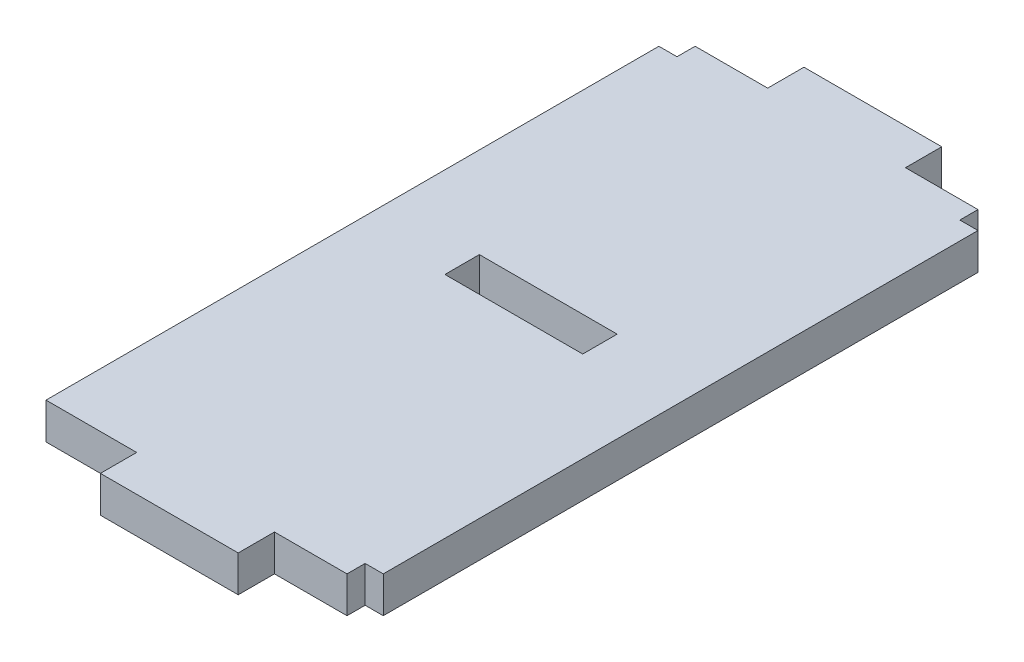
ISO-10303-21;
HEADER;
FILE_DESCRIPTION(('STEP AP214'),'2;1');
FILE_NAME('part.step','',(''),(''),'','','');
FILE_SCHEMA(('AUTOMOTIVE_DESIGN { 1 0 10303 214 1 1 1 1 }'));
ENDSEC;
DATA;
#1=APPLICATION_CONTEXT('core data for automotive mechanical design processes');
#2=APPLICATION_PROTOCOL_DEFINITION('international standard','automotive_design',2000,#1);
#3=PRODUCT_CONTEXT('',#1,'mechanical');
#4=PRODUCT('Part','Part','',(#3));
#5=PRODUCT_RELATED_PRODUCT_CATEGORY('part','',(#4));
#6=PRODUCT_DEFINITION_FORMATION('','',#4);
#7=PRODUCT_DEFINITION_CONTEXT('part definition',#1,'design');
#8=PRODUCT_DEFINITION('design','',#6,#7);
#9=PRODUCT_DEFINITION_SHAPE('','',#8);
#10=(LENGTH_UNIT() NAMED_UNIT(*) SI_UNIT(.MILLI.,.METRE.));
#11=(NAMED_UNIT(*) PLANE_ANGLE_UNIT() SI_UNIT($,.RADIAN.));
#12=(NAMED_UNIT(*) SI_UNIT($,.STERADIAN.) SOLID_ANGLE_UNIT());
#13=UNCERTAINTY_MEASURE_WITH_UNIT(LENGTH_MEASURE(1.E-05),#10,'distance_accuracy_value','');
#14=(GEOMETRIC_REPRESENTATION_CONTEXT(3) GLOBAL_UNCERTAINTY_ASSIGNED_CONTEXT((#13)) GLOBAL_UNIT_ASSIGNED_CONTEXT((#10,
#11,#12)) REPRESENTATION_CONTEXT('',''));
#15=CARTESIAN_POINT('',(0.,0.,0.));
#16=DIRECTION('',(0.,0.,1.));
#17=DIRECTION('',(1.,0.,0.));
#18=AXIS2_PLACEMENT_3D('',#15,#16,#17);
#19=CARTESIAN_POINT('',(0.,2.,0.));
#20=DIRECTION('',(0.,0.,-1.));
#21=DIRECTION('',(-1.,0.,0.));
#22=AXIS2_PLACEMENT_3D('',#19,#20,#21);
#23=PLANE('',#22);
#24=DIRECTION('',(1.,0.,0.));
#25=VECTOR('',#24,1.);
#26=CARTESIAN_POINT('',(0.,0.,0.));
#27=LINE('',#26,#25);
#28=CARTESIAN_POINT('',(0.,0.,0.));
#29=VERTEX_POINT('',#28);
#30=CARTESIAN_POINT('',(5.,0.,0.));
#31=VERTEX_POINT('',#30);
#32=EDGE_CURVE('E233',#29,#31,#27,.T.);
#33=ORIENTED_EDGE('',*,*,#32,.T.);
#34=DIRECTION('',(0.,-1.,0.));
#35=VECTOR('',#34,1.);
#36=CARTESIAN_POINT('',(5.,2.,0.));
#37=LINE('',#36,#35);
#38=CARTESIAN_POINT('',(5.,2.,0.));
#39=VERTEX_POINT('',#38);
#40=EDGE_CURVE('E11',#39,#31,#37,.T.);
#41=ORIENTED_EDGE('',*,*,#40,.F.);
#42=DIRECTION('',(1.,0.,0.));
#43=VECTOR('',#42,1.);
#44=CARTESIAN_POINT('',(0.,2.,0.));
#45=LINE('',#44,#43);
#46=CARTESIAN_POINT('',(0.,2.,0.));
#47=VERTEX_POINT('',#46);
#48=EDGE_CURVE('E624',#47,#39,#45,.T.);
#49=ORIENTED_EDGE('',*,*,#48,.F.);
#50=DIRECTION('',(0.,-1.,0.));
#51=VECTOR('',#50,1.);
#52=CARTESIAN_POINT('',(0.,2.,0.));
#53=LINE('',#52,#51);
#54=EDGE_CURVE('E54',#47,#29,#53,.T.);
#55=ORIENTED_EDGE('',*,*,#54,.T.);
#56=EDGE_LOOP('',(#33,#41,#49,#55));
#57=FACE_BOUND('',#56,.T.);
#58=ADVANCED_FACE('F35',(#57),#23,.F.);
#59=CARTESIAN_POINT('',(5.,2.,0.));
#60=DIRECTION('',(1.,0.,0.));
#61=DIRECTION('',(0.,0.,-1.));
#62=AXIS2_PLACEMENT_3D('',#59,#60,#61);
#63=PLANE('',#62);
#64=DIRECTION('',(0.,0.,1.));
#65=VECTOR('',#64,1.);
#66=CARTESIAN_POINT('',(5.,0.,0.));
#67=LINE('',#66,#65);
#68=CARTESIAN_POINT('',(5.,0.,2.));
#69=VERTEX_POINT('',#68);
#70=EDGE_CURVE('E235',#31,#69,#67,.T.);
#71=ORIENTED_EDGE('',*,*,#70,.T.);
#72=DIRECTION('',(0.,-1.,0.));
#73=VECTOR('',#72,1.);
#74=CARTESIAN_POINT('',(5.,2.,2.));
#75=LINE('',#74,#73);
#76=CARTESIAN_POINT('',(5.,2.,2.));
#77=VERTEX_POINT('',#76);
#78=EDGE_CURVE('E45',#77,#69,#75,.T.);
#79=ORIENTED_EDGE('',*,*,#78,.F.);
#80=DIRECTION('',(0.,0.,1.));
#81=VECTOR('',#80,1.);
#82=CARTESIAN_POINT('',(5.,2.,0.));
#83=LINE('',#82,#81);
#84=EDGE_CURVE('E625',#39,#77,#83,.T.);
#85=ORIENTED_EDGE('',*,*,#84,.F.);
#86=ORIENTED_EDGE('',*,*,#40,.T.);
#87=EDGE_LOOP('',(#71,#79,#85,#86));
#88=FACE_BOUND('',#87,.T.);
#89=ADVANCED_FACE('F340',(#88),#63,.F.);
#90=CARTESIAN_POINT('',(0.,2.,2.));
#91=DIRECTION('',(0.,0.,-1.));
#92=DIRECTION('',(-1.,0.,0.));
#93=AXIS2_PLACEMENT_3D('',#90,#91,#92);
#94=PLANE('',#93);
#95=DIRECTION('',(1.,0.,0.));
#96=VECTOR('',#95,1.);
#97=CARTESIAN_POINT('',(0.,0.,2.));
#98=LINE('',#97,#96);
#99=CARTESIAN_POINT('',(12.6,0.,2.));
#100=VERTEX_POINT('',#99);
#101=EDGE_CURVE('E238',#69,#100,#98,.T.);
#102=ORIENTED_EDGE('',*,*,#101,.T.);
#103=DIRECTION('',(0.,-1.,0.));
#104=VECTOR('',#103,1.);
#105=CARTESIAN_POINT('',(12.6,2.,2.));
#106=LINE('',#105,#104);
#107=CARTESIAN_POINT('',(12.6,2.,2.));
#108=VERTEX_POINT('',#107);
#109=EDGE_CURVE('E305',#108,#100,#106,.T.);
#110=ORIENTED_EDGE('',*,*,#109,.F.);
#111=DIRECTION('',(1.,0.,0.));
#112=VECTOR('',#111,1.);
#113=CARTESIAN_POINT('',(0.,2.,2.));
#114=LINE('',#113,#112);
#115=EDGE_CURVE('E622',#77,#108,#114,.T.);
#116=ORIENTED_EDGE('',*,*,#115,.F.);
#117=ORIENTED_EDGE('',*,*,#78,.T.);
#118=EDGE_LOOP('',(#102,#110,#116,#117));
#119=FACE_BOUND('',#118,.T.);
#120=ADVANCED_FACE('F346',(#119),#94,.F.);
#121=CARTESIAN_POINT('',(12.6,2.,0.));
#122=DIRECTION('',(1.,0.,0.));
#123=DIRECTION('',(0.,0.,-1.));
#124=AXIS2_PLACEMENT_3D('',#121,#122,#123);
#125=PLANE('',#124);
#126=DIRECTION('',(0.,0.,1.));
#127=VECTOR('',#126,1.);
#128=CARTESIAN_POINT('',(12.6,0.,0.));
#129=LINE('',#128,#127);
#130=CARTESIAN_POINT('',(12.6,0.,0.));
#131=VERTEX_POINT('',#130);
#132=EDGE_CURVE('E241',#131,#100,#129,.T.);
#133=ORIENTED_EDGE('',*,*,#132,.F.);
#134=DIRECTION('',(0.,-1.,0.));
#135=VECTOR('',#134,1.);
#136=CARTESIAN_POINT('',(12.6,2.,0.));
#137=LINE('',#136,#135);
#138=CARTESIAN_POINT('',(12.6,2.,0.));
#139=VERTEX_POINT('',#138);
#140=EDGE_CURVE('E303',#139,#131,#137,.T.);
#141=ORIENTED_EDGE('',*,*,#140,.F.);
#142=DIRECTION('',(0.,0.,1.));
#143=VECTOR('',#142,1.);
#144=CARTESIAN_POINT('',(12.6,2.,0.));
#145=LINE('',#144,#143);
#146=EDGE_CURVE('E621',#139,#108,#145,.T.);
#147=ORIENTED_EDGE('',*,*,#146,.T.);
#148=ORIENTED_EDGE('',*,*,#109,.T.);
#149=EDGE_LOOP('',(#133,#141,#147,#148));
#150=FACE_BOUND('',#149,.T.);
#151=ADVANCED_FACE('F353',(#150),#125,.T.);
#152=CARTESIAN_POINT('',(16.6,0.,0.));
#153=VERTEX_POINT('',#152);
#154=EDGE_CURVE('E236',#131,#153,#27,.T.);
#155=ORIENTED_EDGE('',*,*,#154,.T.);
#156=DIRECTION('',(0.,-1.,0.));
#157=VECTOR('',#156,1.);
#158=CARTESIAN_POINT('',(16.6,2.,0.));
#159=LINE('',#158,#157);
#160=CARTESIAN_POINT('',(16.6,2.,0.));
#161=VERTEX_POINT('',#160);
#162=EDGE_CURVE('E300',#161,#153,#159,.T.);
#163=ORIENTED_EDGE('',*,*,#162,.F.);
#164=EDGE_CURVE('E382',#139,#161,#45,.T.);
#165=ORIENTED_EDGE('',*,*,#164,.F.);
#166=ORIENTED_EDGE('',*,*,#140,.T.);
#167=EDGE_LOOP('',(#155,#163,#165,#166));
#168=FACE_BOUND('',#167,.T.);
#169=ADVANCED_FACE('F342',(#168),#23,.F.);
#170=CARTESIAN_POINT('',(16.6,2.,0.));
#171=DIRECTION('',(-1.,0.,0.));
#172=DIRECTION('',(0.,0.,1.));
#173=AXIS2_PLACEMENT_3D('',#170,#171,#172);
#174=PLANE('',#173);
#175=DIRECTION('',(0.,0.,-1.));
#176=VECTOR('',#175,1.);
#177=CARTESIAN_POINT('',(16.6,0.,0.));
#178=LINE('',#177,#176);
#179=CARTESIAN_POINT('',(16.6,0.,-1.));
#180=VERTEX_POINT('',#179);
#181=EDGE_CURVE('E244',#153,#180,#178,.T.);
#182=ORIENTED_EDGE('',*,*,#181,.T.);
#183=DIRECTION('',(0.,-1.,0.));
#184=VECTOR('',#183,1.);
#185=CARTESIAN_POINT('',(16.6,2.,-1.));
#186=LINE('',#185,#184);
#187=CARTESIAN_POINT('',(16.6,2.,-1.));
#188=VERTEX_POINT('',#187);
#189=EDGE_CURVE('E298',#188,#180,#186,.T.);
#190=ORIENTED_EDGE('',*,*,#189,.F.);
#191=DIRECTION('',(0.,0.,-1.));
#192=VECTOR('',#191,1.);
#193=CARTESIAN_POINT('',(16.6,2.,0.));
#194=LINE('',#193,#192);
#195=EDGE_CURVE('E369',#161,#188,#194,.T.);
#196=ORIENTED_EDGE('',*,*,#195,.F.);
#197=ORIENTED_EDGE('',*,*,#162,.T.);
#198=EDGE_LOOP('',(#182,#190,#196,#197));
#199=FACE_BOUND('',#198,.T.);
#200=ADVANCED_FACE('F352',(#199),#174,.F.);
#201=CARTESIAN_POINT('',(0.,2.,-0.999999999999996));
#202=DIRECTION('',(0.,0.,1.));
#203=DIRECTION('',(1.,0.,0.));
#204=AXIS2_PLACEMENT_3D('',#201,#202,#203);
#205=PLANE('',#204);
#206=DIRECTION('',(-1.,0.,0.));
#207=VECTOR('',#206,1.);
#208=CARTESIAN_POINT('',(0.,0.,-0.999999999999996));
#209=LINE('',#208,#207);
#210=CARTESIAN_POINT('',(17.6,0.,-1.));
#211=VERTEX_POINT('',#210);
#212=EDGE_CURVE('E247',#211,#180,#209,.T.);
#213=ORIENTED_EDGE('',*,*,#212,.F.);
#214=DIRECTION('',(0.,-1.,0.));
#215=VECTOR('',#214,1.);
#216=CARTESIAN_POINT('',(17.6,2.,-1.));
#217=LINE('',#216,#215);
#218=CARTESIAN_POINT('',(17.6,2.,-1.));
#219=VERTEX_POINT('',#218);
#220=EDGE_CURVE('E296',#219,#211,#217,.T.);
#221=ORIENTED_EDGE('',*,*,#220,.F.);
#222=DIRECTION('',(-1.,0.,0.));
#223=VECTOR('',#222,1.);
#224=CARTESIAN_POINT('',(0.,2.,-0.999999999999996));
#225=LINE('',#224,#223);
#226=EDGE_CURVE('E377',#219,#188,#225,.T.);
#227=ORIENTED_EDGE('',*,*,#226,.T.);
#228=ORIENTED_EDGE('',*,*,#189,.T.);
#229=EDGE_LOOP('',(#213,#221,#227,#228));
#230=FACE_BOUND('',#229,.T.);
#231=ADVANCED_FACE('F359',(#230),#205,.T.);
#232=CARTESIAN_POINT('',(17.6,2.,0.));
#233=DIRECTION('',(-1.,0.,0.));
#234=DIRECTION('',(0.,0.,1.));
#235=AXIS2_PLACEMENT_3D('',#232,#233,#234);
#236=PLANE('',#235);
#237=DIRECTION('',(0.,0.,-1.));
#238=VECTOR('',#237,1.);
#239=CARTESIAN_POINT('',(17.6,0.,0.));
#240=LINE('',#239,#238);
#241=CARTESIAN_POINT('',(17.6,0.,-33.8));
#242=VERTEX_POINT('',#241);
#243=EDGE_CURVE('E250',#211,#242,#240,.T.);
#244=ORIENTED_EDGE('',*,*,#243,.T.);
#245=DIRECTION('',(0.,-1.,0.));
#246=VECTOR('',#245,1.);
#247=CARTESIAN_POINT('',(17.6,2.,-33.8));
#248=LINE('',#247,#246);
#249=CARTESIAN_POINT('',(17.6,2.,-33.8));
#250=VERTEX_POINT('',#249);
#251=EDGE_CURVE('E293',#250,#242,#248,.T.);
#252=ORIENTED_EDGE('',*,*,#251,.F.);
#253=DIRECTION('',(0.,0.,-1.));
#254=VECTOR('',#253,1.);
#255=CARTESIAN_POINT('',(17.6,2.,0.));
#256=LINE('',#255,#254);
#257=EDGE_CURVE('E378',#219,#250,#256,.T.);
#258=ORIENTED_EDGE('',*,*,#257,.F.);
#259=ORIENTED_EDGE('',*,*,#220,.T.);
#260=EDGE_LOOP('',(#244,#252,#258,#259));
#261=FACE_BOUND('',#260,.T.);
#262=ADVANCED_FACE('F442',(#261),#236,.F.);
#263=CARTESIAN_POINT('',(0.,2.,-33.8));
#264=DIRECTION('',(0.,0.,1.));
#265=DIRECTION('',(1.,0.,0.));
#266=AXIS2_PLACEMENT_3D('',#263,#264,#265);
#267=PLANE('',#266);
#268=DIRECTION('',(-1.,0.,0.));
#269=VECTOR('',#268,1.);
#270=CARTESIAN_POINT('',(0.,0.,-33.8));
#271=LINE('',#270,#269);
#272=CARTESIAN_POINT('',(16.6,0.,-33.8));
#273=VERTEX_POINT('',#272);
#274=EDGE_CURVE('E252',#242,#273,#271,.T.);
#275=ORIENTED_EDGE('',*,*,#274,.T.);
#276=DIRECTION('',(0.,-1.,0.));
#277=VECTOR('',#276,1.);
#278=CARTESIAN_POINT('',(16.6,2.,-33.8));
#279=LINE('',#278,#277);
#280=CARTESIAN_POINT('',(16.6,2.,-33.8));
#281=VERTEX_POINT('',#280);
#282=EDGE_CURVE('E291',#281,#273,#279,.T.);
#283=ORIENTED_EDGE('',*,*,#282,.F.);
#284=DIRECTION('',(-1.,0.,0.));
#285=VECTOR('',#284,1.);
#286=CARTESIAN_POINT('',(0.,2.,-33.8));
#287=LINE('',#286,#285);
#288=EDGE_CURVE('E380',#250,#281,#287,.T.);
#289=ORIENTED_EDGE('',*,*,#288,.F.);
#290=ORIENTED_EDGE('',*,*,#251,.T.);
#291=EDGE_LOOP('',(#275,#283,#289,#290));
#292=FACE_BOUND('',#291,.T.);
#293=ADVANCED_FACE('F438',(#292),#267,.F.);
#294=CARTESIAN_POINT('',(16.6,2.,0.));
#295=DIRECTION('',(1.,0.,0.));
#296=DIRECTION('',(0.,0.,-1.));
#297=AXIS2_PLACEMENT_3D('',#294,#295,#296);
#298=PLANE('',#297);
#299=DIRECTION('',(0.,0.,1.));
#300=VECTOR('',#299,1.);
#301=CARTESIAN_POINT('',(16.6,0.,0.));
#302=LINE('',#301,#300);
#303=CARTESIAN_POINT('',(16.6,0.,-34.8));
#304=VERTEX_POINT('',#303);
#305=EDGE_CURVE('E255',#304,#273,#302,.T.);
#306=ORIENTED_EDGE('',*,*,#305,.F.);
#307=DIRECTION('',(0.,-1.,0.));
#308=VECTOR('',#307,1.);
#309=CARTESIAN_POINT('',(16.6,2.,-34.8));
#310=LINE('',#309,#308);
#311=CARTESIAN_POINT('',(16.6,2.,-34.8));
#312=VERTEX_POINT('',#311);
#313=EDGE_CURVE('E289',#312,#304,#310,.T.);
#314=ORIENTED_EDGE('',*,*,#313,.F.);
#315=DIRECTION('',(0.,0.,1.));
#316=VECTOR('',#315,1.);
#317=CARTESIAN_POINT('',(16.6,2.,0.));
#318=LINE('',#317,#316);
#319=EDGE_CURVE('E387',#312,#281,#318,.T.);
#320=ORIENTED_EDGE('',*,*,#319,.T.);
#321=ORIENTED_EDGE('',*,*,#282,.T.);
#322=EDGE_LOOP('',(#306,#314,#320,#321));
#323=FACE_BOUND('',#322,.T.);
#324=ADVANCED_FACE('F435',(#323),#298,.T.);
#325=CARTESIAN_POINT('',(0.,2.,-34.8));
#326=DIRECTION('',(0.,0.,-1.));
#327=DIRECTION('',(-1.,0.,0.));
#328=AXIS2_PLACEMENT_3D('',#325,#326,#327);
#329=PLANE('',#328);
#330=DIRECTION('',(1.,0.,0.));
#331=VECTOR('',#330,1.);
#332=CARTESIAN_POINT('',(0.,0.,-34.8));
#333=LINE('',#332,#331);
#334=CARTESIAN_POINT('',(12.6,0.,-34.8));
#335=VERTEX_POINT('',#334);
#336=EDGE_CURVE('E258',#335,#304,#333,.T.);
#337=ORIENTED_EDGE('',*,*,#336,.F.);
#338=DIRECTION('',(0.,-1.,0.));
#339=VECTOR('',#338,1.);
#340=CARTESIAN_POINT('',(12.6,2.,-34.8));
#341=LINE('',#340,#339);
#342=CARTESIAN_POINT('',(12.6,2.,-34.8));
#343=VERTEX_POINT('',#342);
#344=EDGE_CURVE('E287',#343,#335,#341,.T.);
#345=ORIENTED_EDGE('',*,*,#344,.F.);
#346=DIRECTION('',(1.,0.,0.));
#347=VECTOR('',#346,1.);
#348=CARTESIAN_POINT('',(0.,2.,-34.8));
#349=LINE('',#348,#347);
#350=EDGE_CURVE('E390',#343,#312,#349,.T.);
#351=ORIENTED_EDGE('',*,*,#350,.T.);
#352=ORIENTED_EDGE('',*,*,#313,.T.);
#353=EDGE_LOOP('',(#337,#345,#351,#352));
#354=FACE_BOUND('',#353,.T.);
#355=ADVANCED_FACE('F423',(#354),#329,.T.);
#356=CARTESIAN_POINT('',(12.6,2.,0.));
#357=DIRECTION('',(1.,0.,0.));
#358=DIRECTION('',(0.,0.,-1.));
#359=AXIS2_PLACEMENT_3D('',#356,#357,#358);
#360=PLANE('',#359);
#361=DIRECTION('',(0.,0.,1.));
#362=VECTOR('',#361,1.);
#363=CARTESIAN_POINT('',(12.6,0.,0.));
#364=LINE('',#363,#362);
#365=CARTESIAN_POINT('',(12.6,0.,-36.8));
#366=VERTEX_POINT('',#365);
#367=EDGE_CURVE('E261',#366,#335,#364,.T.);
#368=ORIENTED_EDGE('',*,*,#367,.F.);
#369=DIRECTION('',(0.,-1.,0.));
#370=VECTOR('',#369,1.);
#371=CARTESIAN_POINT('',(12.6,2.,-36.8));
#372=LINE('',#371,#370);
#373=CARTESIAN_POINT('',(12.6,2.,-36.8));
#374=VERTEX_POINT('',#373);
#375=EDGE_CURVE('E285',#374,#366,#372,.T.);
#376=ORIENTED_EDGE('',*,*,#375,.F.);
#377=DIRECTION('',(0.,0.,1.));
#378=VECTOR('',#377,1.);
#379=CARTESIAN_POINT('',(12.6,2.,0.));
#380=LINE('',#379,#378);
#381=EDGE_CURVE('E393',#374,#343,#380,.T.);
#382=ORIENTED_EDGE('',*,*,#381,.T.);
#383=ORIENTED_EDGE('',*,*,#344,.T.);
#384=EDGE_LOOP('',(#368,#376,#382,#383));
#385=FACE_BOUND('',#384,.T.);
#386=ADVANCED_FACE('F430',(#385),#360,.T.);
#387=CARTESIAN_POINT('',(0.,2.,-36.8));
#388=DIRECTION('',(0.,0.,-1.));
#389=DIRECTION('',(-1.,0.,0.));
#390=AXIS2_PLACEMENT_3D('',#387,#388,#389);
#391=PLANE('',#390);
#392=DIRECTION('',(1.,0.,0.));
#393=VECTOR('',#392,1.);
#394=CARTESIAN_POINT('',(0.,0.,-36.8));
#395=LINE('',#394,#393);
#396=CARTESIAN_POINT('',(5.,0.,-36.8));
#397=VERTEX_POINT('',#396);
#398=EDGE_CURVE('E265',#397,#366,#395,.T.);
#399=ORIENTED_EDGE('',*,*,#398,.F.);
#400=DIRECTION('',(0.,-1.,0.));
#401=VECTOR('',#400,1.);
#402=CARTESIAN_POINT('',(5.,2.,-36.8));
#403=LINE('',#402,#401);
#404=CARTESIAN_POINT('',(5.,2.,-36.8));
#405=VERTEX_POINT('',#404);
#406=EDGE_CURVE('E283',#405,#397,#403,.T.);
#407=ORIENTED_EDGE('',*,*,#406,.F.);
#408=DIRECTION('',(1.,0.,0.));
#409=VECTOR('',#408,1.);
#410=CARTESIAN_POINT('',(0.,2.,-36.8));
#411=LINE('',#410,#409);
#412=EDGE_CURVE('E396',#405,#374,#411,.T.);
#413=ORIENTED_EDGE('',*,*,#412,.T.);
#414=ORIENTED_EDGE('',*,*,#375,.T.);
#415=EDGE_LOOP('',(#399,#407,#413,#414));
#416=FACE_BOUND('',#415,.T.);
#417=ADVANCED_FACE('F426',(#416),#391,.T.);
#418=CARTESIAN_POINT('',(5.,2.,0.));
#419=DIRECTION('',(1.,0.,0.));
#420=DIRECTION('',(0.,0.,-1.));
#421=AXIS2_PLACEMENT_3D('',#418,#419,#420);
#422=PLANE('',#421);
#423=DIRECTION('',(0.,0.,1.));
#424=VECTOR('',#423,1.);
#425=CARTESIAN_POINT('',(5.,0.,0.));
#426=LINE('',#425,#424);
#427=CARTESIAN_POINT('',(5.,0.,-34.8));
#428=VERTEX_POINT('',#427);
#429=EDGE_CURVE('E268',#397,#428,#426,.T.);
#430=ORIENTED_EDGE('',*,*,#429,.T.);
#431=DIRECTION('',(0.,-1.,0.));
#432=VECTOR('',#431,1.);
#433=CARTESIAN_POINT('',(5.,2.,-34.8));
#434=LINE('',#433,#432);
#435=CARTESIAN_POINT('',(5.,2.,-34.8));
#436=VERTEX_POINT('',#435);
#437=EDGE_CURVE('E281',#436,#428,#434,.T.);
#438=ORIENTED_EDGE('',*,*,#437,.F.);
#439=DIRECTION('',(0.,0.,1.));
#440=VECTOR('',#439,1.);
#441=CARTESIAN_POINT('',(5.,2.,0.));
#442=LINE('',#441,#440);
#443=EDGE_CURVE('E398',#405,#436,#442,.T.);
#444=ORIENTED_EDGE('',*,*,#443,.F.);
#445=ORIENTED_EDGE('',*,*,#406,.T.);
#446=EDGE_LOOP('',(#430,#438,#444,#445));
#447=FACE_BOUND('',#446,.T.);
#448=ADVANCED_FACE('F422',(#447),#422,.F.);
#449=CARTESIAN_POINT('',(1.,0.,-34.8));
#450=VERTEX_POINT('',#449);
#451=EDGE_CURVE('E262',#450,#428,#333,.T.);
#452=ORIENTED_EDGE('',*,*,#451,.F.);
#453=DIRECTION('',(0.,-1.,0.));
#454=VECTOR('',#453,1.);
#455=CARTESIAN_POINT('',(1.,2.,-34.8));
#456=LINE('',#455,#454);
#457=CARTESIAN_POINT('',(1.,2.,-34.8));
#458=VERTEX_POINT('',#457);
#459=EDGE_CURVE('E212',#458,#450,#456,.T.);
#460=ORIENTED_EDGE('',*,*,#459,.F.);
#461=EDGE_CURVE('E202',#458,#436,#349,.T.);
#462=ORIENTED_EDGE('',*,*,#461,.T.);
#463=ORIENTED_EDGE('',*,*,#437,.T.);
#464=EDGE_LOOP('',(#452,#460,#462,#463));
#465=FACE_BOUND('',#464,.T.);
#466=ADVANCED_FACE('F404',(#465),#329,.T.);
#467=CARTESIAN_POINT('',(1.00000000000001,2.,0.));
#468=DIRECTION('',(1.,0.,0.));
#469=DIRECTION('',(0.,0.,-1.));
#470=AXIS2_PLACEMENT_3D('',#467,#468,#469);
#471=PLANE('',#470);
#472=DIRECTION('',(0.,0.,1.));
#473=VECTOR('',#472,1.);
#474=CARTESIAN_POINT('',(1.00000000000001,0.,0.));
#475=LINE('',#474,#473);
#476=CARTESIAN_POINT('',(1.,0.,-33.8));
#477=VERTEX_POINT('',#476);
#478=EDGE_CURVE('E209',#450,#477,#475,.T.);
#479=ORIENTED_EDGE('',*,*,#478,.T.);
#480=DIRECTION('',(0.,-1.,0.));
#481=VECTOR('',#480,1.);
#482=CARTESIAN_POINT('',(1.,2.,-33.8));
#483=LINE('',#482,#481);
#484=CARTESIAN_POINT('',(1.,2.,-33.8));
#485=VERTEX_POINT('',#484);
#486=EDGE_CURVE('E206',#485,#477,#483,.T.);
#487=ORIENTED_EDGE('',*,*,#486,.F.);
#488=DIRECTION('',(0.,0.,1.));
#489=VECTOR('',#488,1.);
#490=CARTESIAN_POINT('',(1.00000000000001,2.,0.));
#491=LINE('',#490,#489);
#492=EDGE_CURVE('E194',#458,#485,#491,.T.);
#493=ORIENTED_EDGE('',*,*,#492,.F.);
#494=ORIENTED_EDGE('',*,*,#459,.T.);
#495=EDGE_LOOP('',(#479,#487,#493,#494));
#496=FACE_BOUND('',#495,.T.);
#497=ADVANCED_FACE('F207',(#496),#471,.F.);
#498=CARTESIAN_POINT('',(0.,2.,-33.8));
#499=DIRECTION('',(0.,0.,-1.));
#500=DIRECTION('',(-1.,0.,0.));
#501=AXIS2_PLACEMENT_3D('',#498,#499,#500);
#502=PLANE('',#501);
#503=DIRECTION('',(1.,0.,0.));
#504=VECTOR('',#503,1.);
#505=CARTESIAN_POINT('',(0.,0.,-33.8));
#506=LINE('',#505,#504);
#507=CARTESIAN_POINT('',(0.,0.,-33.8));
#508=VERTEX_POINT('',#507);
#509=EDGE_CURVE('E272',#508,#477,#506,.T.);
#510=ORIENTED_EDGE('',*,*,#509,.F.);
#511=DIRECTION('',(0.,-1.,0.));
#512=VECTOR('',#511,1.);
#513=CARTESIAN_POINT('',(0.,2.,-33.8));
#514=LINE('',#513,#512);
#515=CARTESIAN_POINT('',(0.,2.,-33.8));
#516=VERTEX_POINT('',#515);
#517=EDGE_CURVE('E122',#516,#508,#514,.T.);
#518=ORIENTED_EDGE('',*,*,#517,.F.);
#519=DIRECTION('',(1.,0.,0.));
#520=VECTOR('',#519,1.);
#521=CARTESIAN_POINT('',(0.,2.,-33.8));
#522=LINE('',#521,#520);
#523=EDGE_CURVE('E200',#516,#485,#522,.T.);
#524=ORIENTED_EDGE('',*,*,#523,.T.);
#525=ORIENTED_EDGE('',*,*,#486,.T.);
#526=EDGE_LOOP('',(#510,#518,#524,#525));
#527=FACE_BOUND('',#526,.T.);
#528=ADVANCED_FACE('F214',(#527),#502,.T.);
#529=CARTESIAN_POINT('',(0.,2.,-18.9));
#530=DIRECTION('',(0.,0.,-1.));
#531=DIRECTION('',(-1.,0.,0.));
#532=AXIS2_PLACEMENT_3D('',#529,#530,#531);
#533=PLANE('',#532);
#534=DIRECTION('',(1.,0.,0.));
#535=VECTOR('',#534,1.);
#536=CARTESIAN_POINT('',(0.,0.,-18.9));
#537=LINE('',#536,#535);
#538=CARTESIAN_POINT('',(5.,0.,-18.9));
#539=VERTEX_POINT('',#538);
#540=CARTESIAN_POINT('',(12.6,0.,-18.9));
#541=VERTEX_POINT('',#540);
#542=EDGE_CURVE('E221',#539,#541,#537,.T.);
#543=ORIENTED_EDGE('',*,*,#542,.T.);
#544=DIRECTION('',(0.,-1.,0.));
#545=VECTOR('',#544,1.);
#546=CARTESIAN_POINT('',(12.6,2.,-18.9));
#547=LINE('',#546,#545);
#548=CARTESIAN_POINT('',(12.6,2.,-18.9));
#549=VERTEX_POINT('',#548);
#550=EDGE_CURVE('E39',#549,#541,#547,.T.);
#551=ORIENTED_EDGE('',*,*,#550,.F.);
#552=DIRECTION('',(1.,0.,0.));
#553=VECTOR('',#552,1.);
#554=CARTESIAN_POINT('',(0.,2.,-18.9));
#555=LINE('',#554,#553);
#556=CARTESIAN_POINT('',(5.,2.,-18.9));
#557=VERTEX_POINT('',#556);
#558=EDGE_CURVE('E277',#557,#549,#555,.T.);
#559=ORIENTED_EDGE('',*,*,#558,.F.);
#560=DIRECTION('',(0.,-1.,0.));
#561=VECTOR('',#560,1.);
#562=CARTESIAN_POINT('',(5.,2.,-18.9));
#563=LINE('',#562,#561);
#564=EDGE_CURVE('E217',#557,#539,#563,.T.);
#565=ORIENTED_EDGE('',*,*,#564,.T.);
#566=EDGE_LOOP('',(#543,#551,#559,#565));
#567=FACE_BOUND('',#566,.T.);
#568=ADVANCED_FACE('F37',(#567),#533,.F.);
#569=CARTESIAN_POINT('',(12.6,2.,0.));
#570=DIRECTION('',(1.,0.,0.));
#571=DIRECTION('',(0.,0.,-1.));
#572=AXIS2_PLACEMENT_3D('',#569,#570,#571);
#573=PLANE('',#572);
#574=DIRECTION('',(0.,0.,1.));
#575=VECTOR('',#574,1.);
#576=CARTESIAN_POINT('',(12.6,0.,0.));
#577=LINE('',#576,#575);
#578=CARTESIAN_POINT('',(12.6,0.,-17.));
#579=VERTEX_POINT('',#578);
#580=EDGE_CURVE('E224',#541,#579,#577,.T.);
#581=ORIENTED_EDGE('',*,*,#580,.T.);
#582=DIRECTION('',(0.,-1.,0.));
#583=VECTOR('',#582,1.);
#584=CARTESIAN_POINT('',(12.6,2.,-17.));
#585=LINE('',#584,#583);
#586=CARTESIAN_POINT('',(12.6,2.,-17.));
#587=VERTEX_POINT('',#586);
#588=EDGE_CURVE('E311',#587,#579,#585,.T.);
#589=ORIENTED_EDGE('',*,*,#588,.F.);
#590=DIRECTION('',(0.,0.,1.));
#591=VECTOR('',#590,1.);
#592=CARTESIAN_POINT('',(12.6,2.,0.));
#593=LINE('',#592,#591);
#594=EDGE_CURVE('E135',#549,#587,#593,.T.);
#595=ORIENTED_EDGE('',*,*,#594,.F.);
#596=ORIENTED_EDGE('',*,*,#550,.T.);
#597=EDGE_LOOP('',(#581,#589,#595,#596));
#598=FACE_BOUND('',#597,.T.);
#599=ADVANCED_FACE('F316',(#598),#573,.F.);
#600=CARTESIAN_POINT('',(0.,2.,-17.));
#601=DIRECTION('',(0.,0.,-1.));
#602=DIRECTION('',(-1.,0.,0.));
#603=AXIS2_PLACEMENT_3D('',#600,#601,#602);
#604=PLANE('',#603);
#605=DIRECTION('',(1.,0.,0.));
#606=VECTOR('',#605,1.);
#607=CARTESIAN_POINT('',(0.,0.,-17.));
#608=LINE('',#607,#606);
#609=CARTESIAN_POINT('',(5.,0.,-17.));
#610=VERTEX_POINT('',#609);
#611=EDGE_CURVE('E227',#610,#579,#608,.T.);
#612=ORIENTED_EDGE('',*,*,#611,.F.);
#613=DIRECTION('',(0.,-1.,0.));
#614=VECTOR('',#613,1.);
#615=CARTESIAN_POINT('',(5.,2.,-17.));
#616=LINE('',#615,#614);
#617=CARTESIAN_POINT('',(5.,2.,-17.));
#618=VERTEX_POINT('',#617);
#619=EDGE_CURVE('E310',#618,#610,#616,.T.);
#620=ORIENTED_EDGE('',*,*,#619,.F.);
#621=DIRECTION('',(1.,0.,0.));
#622=VECTOR('',#621,1.);
#623=CARTESIAN_POINT('',(0.,2.,-17.));
#624=LINE('',#623,#622);
#625=EDGE_CURVE('E630',#618,#587,#624,.T.);
#626=ORIENTED_EDGE('',*,*,#625,.T.);
#627=ORIENTED_EDGE('',*,*,#588,.T.);
#628=EDGE_LOOP('',(#612,#620,#626,#627));
#629=FACE_BOUND('',#628,.T.);
#630=ADVANCED_FACE('F330',(#629),#604,.T.);
#631=CARTESIAN_POINT('',(5.,2.,0.));
#632=DIRECTION('',(1.,0.,0.));
#633=DIRECTION('',(0.,0.,-1.));
#634=AXIS2_PLACEMENT_3D('',#631,#632,#633);
#635=PLANE('',#634);
#636=DIRECTION('',(0.,0.,1.));
#637=VECTOR('',#636,1.);
#638=CARTESIAN_POINT('',(5.,0.,0.));
#639=LINE('',#638,#637);
#640=EDGE_CURVE('E230',#539,#610,#639,.T.);
#641=ORIENTED_EDGE('',*,*,#640,.F.);
#642=ORIENTED_EDGE('',*,*,#564,.F.);
#643=DIRECTION('',(0.,0.,1.));
#644=VECTOR('',#643,1.);
#645=CARTESIAN_POINT('',(5.,2.,0.));
#646=LINE('',#645,#644);
#647=EDGE_CURVE('E328',#557,#618,#646,.T.);
#648=ORIENTED_EDGE('',*,*,#647,.T.);
#649=ORIENTED_EDGE('',*,*,#619,.T.);
#650=EDGE_LOOP('',(#641,#642,#648,#649));
#651=FACE_BOUND('',#650,.T.);
#652=ADVANCED_FACE('F325',(#651),#635,.T.);
#653=CARTESIAN_POINT('',(0.,2.,0.));
#654=DIRECTION('',(-1.,0.,0.));
#655=DIRECTION('',(0.,0.,1.));
#656=AXIS2_PLACEMENT_3D('',#653,#654,#655);
#657=PLANE('',#656);
#658=DIRECTION('',(0.,0.,-1.));
#659=VECTOR('',#658,1.);
#660=CARTESIAN_POINT('',(0.,0.,0.));
#661=LINE('',#660,#659);
#662=EDGE_CURVE('E274',#29,#508,#661,.T.);
#663=ORIENTED_EDGE('',*,*,#662,.F.);
#664=ORIENTED_EDGE('',*,*,#54,.F.);
#665=DIRECTION('',(0.,0.,-1.));
#666=VECTOR('',#665,1.);
#667=CARTESIAN_POINT('',(0.,2.,0.));
#668=LINE('',#667,#666);
#669=EDGE_CURVE('E215',#47,#516,#668,.T.);
#670=ORIENTED_EDGE('',*,*,#669,.T.);
#671=ORIENTED_EDGE('',*,*,#517,.T.);
#672=EDGE_LOOP('',(#663,#664,#670,#671));
#673=FACE_BOUND('',#672,.T.);
#674=ADVANCED_FACE('F337',(#673),#657,.T.);
#675=CARTESIAN_POINT('',(0.,2.,0.));
#676=DIRECTION('',(0.,1.,0.));
#677=DIRECTION('',(0.,0.,1.));
#678=AXIS2_PLACEMENT_3D('',#675,#676,#677);
#679=PLANE('',#678);
#680=ORIENTED_EDGE('',*,*,#558,.T.);
#681=ORIENTED_EDGE('',*,*,#594,.T.);
#682=ORIENTED_EDGE('',*,*,#625,.F.);
#683=ORIENTED_EDGE('',*,*,#647,.F.);
#684=EDGE_LOOP('',(#680,#681,#682,#683));
#685=FACE_BOUND('',#684,.T.);
#686=ORIENTED_EDGE('',*,*,#48,.T.);
#687=ORIENTED_EDGE('',*,*,#84,.T.);
#688=ORIENTED_EDGE('',*,*,#115,.T.);
#689=ORIENTED_EDGE('',*,*,#146,.F.);
#690=ORIENTED_EDGE('',*,*,#164,.T.);
#691=ORIENTED_EDGE('',*,*,#195,.T.);
#692=ORIENTED_EDGE('',*,*,#226,.F.);
#693=ORIENTED_EDGE('',*,*,#257,.T.);
#694=ORIENTED_EDGE('',*,*,#288,.T.);
#695=ORIENTED_EDGE('',*,*,#319,.F.);
#696=ORIENTED_EDGE('',*,*,#350,.F.);
#697=ORIENTED_EDGE('',*,*,#381,.F.);
#698=ORIENTED_EDGE('',*,*,#412,.F.);
#699=ORIENTED_EDGE('',*,*,#443,.T.);
#700=ORIENTED_EDGE('',*,*,#461,.F.);
#701=ORIENTED_EDGE('',*,*,#492,.T.);
#702=ORIENTED_EDGE('',*,*,#523,.F.);
#703=ORIENTED_EDGE('',*,*,#669,.F.);
#704=EDGE_LOOP('',(#686,#687,#688,#689,#690,#691,#692,#693,#694,#695,#696,#697,#698,#699,#700,
#701,#702,#703));
#705=FACE_BOUND('',#704,.T.);
#706=ADVANCED_FACE('F197',(#685,#705),#679,.T.);
#707=CARTESIAN_POINT('',(0.,0.,0.));
#708=DIRECTION('',(0.,1.,0.));
#709=DIRECTION('',(0.,0.,1.));
#710=AXIS2_PLACEMENT_3D('',#707,#708,#709);
#711=PLANE('',#710);
#712=ORIENTED_EDGE('',*,*,#542,.F.);
#713=ORIENTED_EDGE('',*,*,#640,.T.);
#714=ORIENTED_EDGE('',*,*,#611,.T.);
#715=ORIENTED_EDGE('',*,*,#580,.F.);
#716=EDGE_LOOP('',(#712,#713,#714,#715));
#717=FACE_BOUND('',#716,.T.);
#718=ORIENTED_EDGE('',*,*,#32,.F.);
#719=ORIENTED_EDGE('',*,*,#662,.T.);
#720=ORIENTED_EDGE('',*,*,#509,.T.);
#721=ORIENTED_EDGE('',*,*,#478,.F.);
#722=ORIENTED_EDGE('',*,*,#451,.T.);
#723=ORIENTED_EDGE('',*,*,#429,.F.);
#724=ORIENTED_EDGE('',*,*,#398,.T.);
#725=ORIENTED_EDGE('',*,*,#367,.T.);
#726=ORIENTED_EDGE('',*,*,#336,.T.);
#727=ORIENTED_EDGE('',*,*,#305,.T.);
#728=ORIENTED_EDGE('',*,*,#274,.F.);
#729=ORIENTED_EDGE('',*,*,#243,.F.);
#730=ORIENTED_EDGE('',*,*,#212,.T.);
#731=ORIENTED_EDGE('',*,*,#181,.F.);
#732=ORIENTED_EDGE('',*,*,#154,.F.);
#733=ORIENTED_EDGE('',*,*,#132,.T.);
#734=ORIENTED_EDGE('',*,*,#101,.F.);
#735=ORIENTED_EDGE('',*,*,#70,.F.);
#736=EDGE_LOOP('',(#718,#719,#720,#721,#722,#723,#724,#725,#726,#727,#728,#729,#730,#731,#732,
#733,#734,#735));
#737=FACE_BOUND('',#736,.T.);
#738=ADVANCED_FACE('F322',(#717,#737),#711,.F.);
#739=CLOSED_SHELL('',(#58,#89,#120,#151,#169,#200,#231,#262,#293,#324,#355,#386,#417,#448,#466,
#497,#528,#568,#599,#630,#652,#674,#706,#738));
#740=MANIFOLD_SOLID_BREP('B2',#739);
#741=ADVANCED_BREP_SHAPE_REPRESENTATION('',(#18,#740),#14);
#742=SHAPE_DEFINITION_REPRESENTATION(#9,#741);
ENDSEC;
END-ISO-10303-21;
